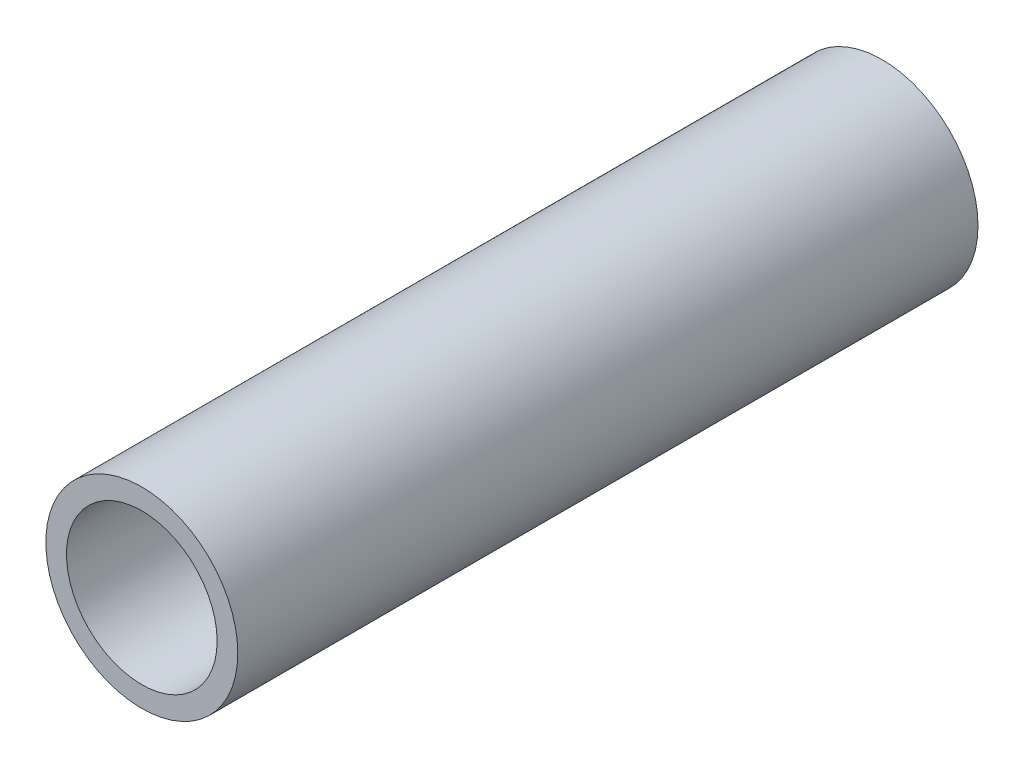
ISO-10303-21;
HEADER;
FILE_DESCRIPTION(('STEP AP214'),'2;1');
FILE_NAME('part.step','',(''),(''),'','','');
FILE_SCHEMA(('AUTOMOTIVE_DESIGN { 1 0 10303 214 1 1 1 1 }'));
ENDSEC;
DATA;
#1=APPLICATION_CONTEXT('core data for automotive mechanical design processes');
#2=APPLICATION_PROTOCOL_DEFINITION('international standard','automotive_design',2000,#1);
#3=PRODUCT_CONTEXT('',#1,'mechanical');
#4=PRODUCT('Part','Part','',(#3));
#5=PRODUCT_RELATED_PRODUCT_CATEGORY('part','',(#4));
#6=PRODUCT_DEFINITION_FORMATION('','',#4);
#7=PRODUCT_DEFINITION_CONTEXT('part definition',#1,'design');
#8=PRODUCT_DEFINITION('design','',#6,#7);
#9=PRODUCT_DEFINITION_SHAPE('','',#8);
#10=(LENGTH_UNIT() NAMED_UNIT(*) SI_UNIT(.MILLI.,.METRE.));
#11=(NAMED_UNIT(*) PLANE_ANGLE_UNIT() SI_UNIT($,.RADIAN.));
#12=(NAMED_UNIT(*) SI_UNIT($,.STERADIAN.) SOLID_ANGLE_UNIT());
#13=UNCERTAINTY_MEASURE_WITH_UNIT(LENGTH_MEASURE(1.E-05),#10,'distance_accuracy_value','');
#14=(GEOMETRIC_REPRESENTATION_CONTEXT(3) GLOBAL_UNCERTAINTY_ASSIGNED_CONTEXT((#13)) GLOBAL_UNIT_ASSIGNED_CONTEXT((#10,
#11,#12)) REPRESENTATION_CONTEXT('',''));
#15=CARTESIAN_POINT('',(0.,0.,0.));
#16=DIRECTION('',(0.,0.,1.));
#17=DIRECTION('',(1.,0.,0.));
#18=AXIS2_PLACEMENT_3D('',#15,#16,#17);
#19=CARTESIAN_POINT('',(0.,0.,762.));
#20=DIRECTION('',(0.,0.,-1.));
#21=DIRECTION('',(-1.,0.,0.));
#22=AXIS2_PLACEMENT_3D('',#19,#20,#21);
#23=CYLINDRICAL_SURFACE('',#22,13.335);
#24=CARTESIAN_POINT('',(0.,0.,-762.));
#25=DIRECTION('',(0.,0.,1.));
#26=DIRECTION('',(1.,0.,0.));
#27=AXIS2_PLACEMENT_3D('',#24,#25,#26);
#28=CIRCLE('',#27,13.335);
#29=CARTESIAN_POINT('',(13.335,0.,-762.));
#30=VERTEX_POINT('',#29);
#31=EDGE_CURVE('E11',#30,#30,#28,.T.);
#32=ORIENTED_EDGE('',*,*,#31,.T.);
#33=EDGE_LOOP('',(#32));
#34=FACE_BOUND('',#33,.T.);
#35=CARTESIAN_POINT('',(0.,0.,-659.14546875));
#36=DIRECTION('',(0.,0.,1.));
#37=DIRECTION('',(1.,0.,0.));
#38=AXIS2_PLACEMENT_3D('',#35,#36,#37);
#39=CIRCLE('',#38,13.335);
#40=CARTESIAN_POINT('',(13.335,0.,-659.14546875));
#41=VERTEX_POINT('',#40);
#42=EDGE_CURVE('E58',#41,#41,#39,.F.);
#43=ORIENTED_EDGE('',*,*,#42,.T.);
#44=EDGE_LOOP('',(#43));
#45=FACE_BOUND('',#44,.T.);
#46=ADVANCED_FACE('F43',(#34,#45),#23,.T.);
#47=CARTESIAN_POINT('',(0.,0.,762.));
#48=DIRECTION('',(0.,0.,-1.));
#49=DIRECTION('',(-1.,0.,0.));
#50=AXIS2_PLACEMENT_3D('',#47,#48,#49);
#51=CYLINDRICAL_SURFACE('',#50,10.4648);
#52=CARTESIAN_POINT('',(0.,0.,-762.));
#53=DIRECTION('',(0.,0.,1.));
#54=DIRECTION('',(1.,0.,0.));
#55=AXIS2_PLACEMENT_3D('',#52,#53,#54);
#56=CIRCLE('',#55,10.4648);
#57=CARTESIAN_POINT('',(10.4648,0.,-762.));
#58=VERTEX_POINT('',#57);
#59=EDGE_CURVE('E51',#58,#58,#56,.T.);
#60=ORIENTED_EDGE('',*,*,#59,.F.);
#61=EDGE_LOOP('',(#60));
#62=FACE_BOUND('',#61,.T.);
#63=CARTESIAN_POINT('',(0.,0.,-659.14546875));
#64=DIRECTION('',(0.,0.,1.));
#65=DIRECTION('',(1.,0.,0.));
#66=AXIS2_PLACEMENT_3D('',#63,#64,#65);
#67=CIRCLE('',#66,10.4648);
#68=CARTESIAN_POINT('',(10.4648,0.,-659.14546875));
#69=VERTEX_POINT('',#68);
#70=EDGE_CURVE('E46',#69,#69,#67,.T.);
#71=ORIENTED_EDGE('',*,*,#70,.T.);
#72=EDGE_LOOP('',(#71));
#73=FACE_BOUND('',#72,.T.);
#74=ADVANCED_FACE('F67',(#62,#73),#51,.F.);
#75=CARTESIAN_POINT('',(0.,0.,-762.));
#76=DIRECTION('',(0.,0.,1.));
#77=DIRECTION('',(1.,0.,0.));
#78=AXIS2_PLACEMENT_3D('',#75,#76,#77);
#79=PLANE('',#78);
#80=ORIENTED_EDGE('',*,*,#59,.T.);
#81=EDGE_LOOP('',(#80));
#82=FACE_BOUND('',#81,.T.);
#83=ORIENTED_EDGE('',*,*,#31,.F.);
#84=EDGE_LOOP('',(#83));
#85=FACE_BOUND('',#84,.T.);
#86=ADVANCED_FACE('F72',(#82,#85),#79,.F.);
#87=CARTESIAN_POINT('',(0.,0.,-659.14546875));
#88=DIRECTION('',(0.,0.,1.));
#89=DIRECTION('',(1.,0.,0.));
#90=AXIS2_PLACEMENT_3D('',#87,#88,#89);
#91=PLANE('',#90);
#92=ORIENTED_EDGE('',*,*,#70,.F.);
#93=EDGE_LOOP('',(#92));
#94=FACE_BOUND('',#93,.T.);
#95=ORIENTED_EDGE('',*,*,#42,.F.);
#96=EDGE_LOOP('',(#95));
#97=FACE_BOUND('',#96,.T.);
#98=ADVANCED_FACE('F69',(#94,#97),#91,.T.);
#99=CLOSED_SHELL('',(#46,#74,#86,#98));
#100=MANIFOLD_SOLID_BREP('B2',#99);
#101=ADVANCED_BREP_SHAPE_REPRESENTATION('',(#18,#100),#14);
#102=SHAPE_DEFINITION_REPRESENTATION(#9,#101);
ENDSEC;
END-ISO-10303-21;
